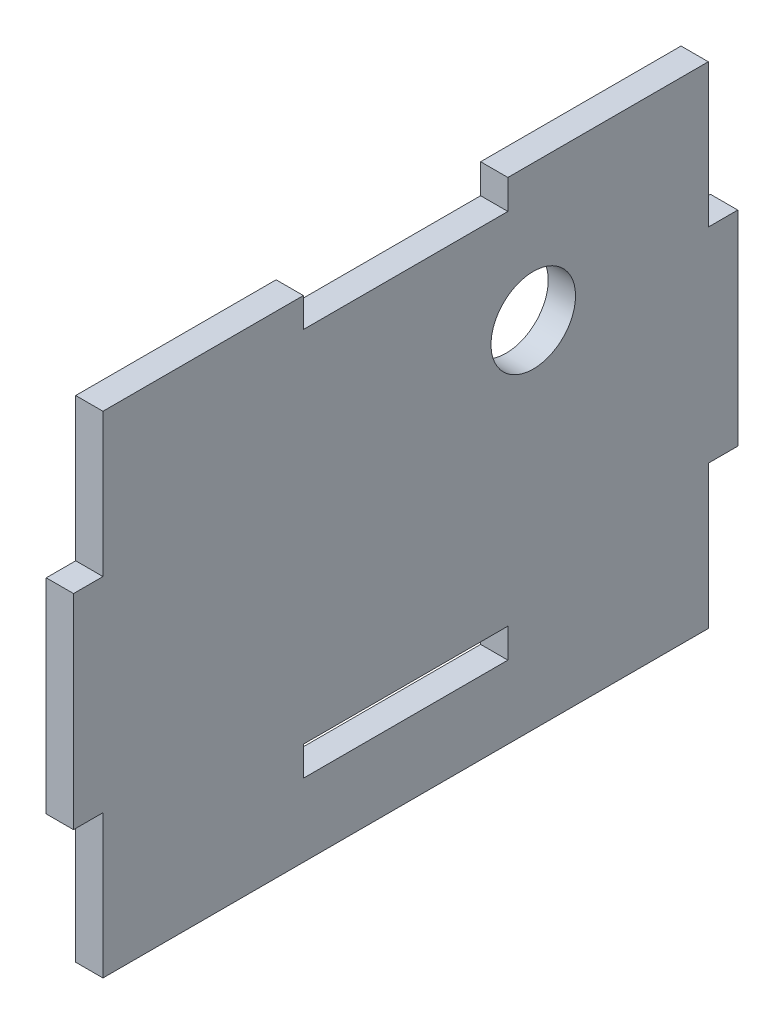
ISO-10303-21;
HEADER;
FILE_DESCRIPTION(('STEP AP214'),'2;1');
FILE_NAME('part.step','',(''),(''),'','','');
FILE_SCHEMA(('AUTOMOTIVE_DESIGN { 1 0 10303 214 1 1 1 1 }'));
ENDSEC;
DATA;
#1=APPLICATION_CONTEXT('core data for automotive mechanical design processes');
#2=APPLICATION_PROTOCOL_DEFINITION('international standard','automotive_design',2000,#1);
#3=PRODUCT_CONTEXT('',#1,'mechanical');
#4=PRODUCT('Part','Part','',(#3));
#5=PRODUCT_RELATED_PRODUCT_CATEGORY('part','',(#4));
#6=PRODUCT_DEFINITION_FORMATION('','',#4);
#7=PRODUCT_DEFINITION_CONTEXT('part definition',#1,'design');
#8=PRODUCT_DEFINITION('design','',#6,#7);
#9=PRODUCT_DEFINITION_SHAPE('','',#8);
#10=(LENGTH_UNIT() NAMED_UNIT(*) SI_UNIT(.MILLI.,.METRE.));
#11=(NAMED_UNIT(*) PLANE_ANGLE_UNIT() SI_UNIT($,.RADIAN.));
#12=(NAMED_UNIT(*) SI_UNIT($,.STERADIAN.) SOLID_ANGLE_UNIT());
#13=UNCERTAINTY_MEASURE_WITH_UNIT(LENGTH_MEASURE(1.E-05),#10,'distance_accuracy_value','');
#14=(GEOMETRIC_REPRESENTATION_CONTEXT(3) GLOBAL_UNCERTAINTY_ASSIGNED_CONTEXT((#13)) GLOBAL_UNIT_ASSIGNED_CONTEXT((#10,
#11,#12)) REPRESENTATION_CONTEXT('',''));
#15=CARTESIAN_POINT('',(0.,0.,0.));
#16=DIRECTION('',(0.,0.,1.));
#17=DIRECTION('',(1.,0.,0.));
#18=AXIS2_PLACEMENT_3D('',#15,#16,#17);
#19=CARTESIAN_POINT('',(2.54,22.86,-28.194));
#20=DIRECTION('',(0.,-1.,0.));
#21=DIRECTION('',(0.,0.,-1.));
#22=AXIS2_PLACEMENT_3D('',#19,#20,#21);
#23=PLANE('',#22);
#24=DIRECTION('',(0.,0.,1.));
#25=VECTOR('',#24,1.);
#26=CARTESIAN_POINT('',(0.,22.86,-28.194));
#27=LINE('',#26,#25);
#28=CARTESIAN_POINT('',(0.,22.86,-28.194));
#29=VERTEX_POINT('',#28);
#30=CARTESIAN_POINT('',(0.,22.86,-9.52499999999999));
#31=VERTEX_POINT('',#30);
#32=EDGE_CURVE('E186',#29,#31,#27,.T.);
#33=ORIENTED_EDGE('',*,*,#32,.T.);
#34=DIRECTION('',(1.,0.,0.));
#35=VECTOR('',#34,1.);
#36=CARTESIAN_POINT('',(0.,22.86,-9.52499999999999));
#37=LINE('',#36,#35);
#38=CARTESIAN_POINT('',(2.54,22.86,-9.52499999999999));
#39=VERTEX_POINT('',#38);
#40=EDGE_CURVE('E170',#31,#39,#37,.T.);
#41=ORIENTED_EDGE('',*,*,#40,.T.);
#42=DIRECTION('',(0.,0.,1.));
#43=VECTOR('',#42,1.);
#44=CARTESIAN_POINT('',(2.54,22.86,-28.194));
#45=LINE('',#44,#43);
#46=CARTESIAN_POINT('',(2.54,22.86,-28.194));
#47=VERTEX_POINT('',#46);
#48=EDGE_CURVE('E206',#47,#39,#45,.T.);
#49=ORIENTED_EDGE('',*,*,#48,.F.);
#50=DIRECTION('',(-1.,0.,0.));
#51=VECTOR('',#50,1.);
#52=CARTESIAN_POINT('',(2.54,22.86,-28.194));
#53=LINE('',#52,#51);
#54=EDGE_CURVE('E193',#47,#29,#53,.T.);
#55=ORIENTED_EDGE('',*,*,#54,.T.);
#56=EDGE_LOOP('',(#33,#41,#49,#55));
#57=FACE_BOUND('',#56,.T.);
#58=ADVANCED_FACE('F33',(#57),#23,.F.);
#59=CARTESIAN_POINT('',(2.54,-22.86,-28.194));
#60=DIRECTION('',(0.,0.,1.));
#61=DIRECTION('',(1.,0.,0.));
#62=AXIS2_PLACEMENT_3D('',#59,#60,#61);
#63=PLANE('',#62);
#64=DIRECTION('',(1.,0.,0.));
#65=VECTOR('',#64,1.);
#66=CARTESIAN_POINT('',(-19.246496986205,9.525,-28.194));
#67=LINE('',#66,#65);
#68=CARTESIAN_POINT('',(0.,9.525,-28.194));
#69=VERTEX_POINT('',#68);
#70=CARTESIAN_POINT('',(2.54,9.525,-28.194));
#71=VERTEX_POINT('',#70);
#72=EDGE_CURVE('E271',#69,#71,#67,.T.);
#73=ORIENTED_EDGE('',*,*,#72,.F.);
#74=DIRECTION('',(0.,1.,0.));
#75=VECTOR('',#74,1.);
#76=CARTESIAN_POINT('',(0.,-22.86,-28.194));
#77=LINE('',#76,#75);
#78=EDGE_CURVE('E224',#69,#29,#77,.T.);
#79=ORIENTED_EDGE('',*,*,#78,.T.);
#80=ORIENTED_EDGE('',*,*,#54,.F.);
#81=DIRECTION('',(0.,1.,0.));
#82=VECTOR('',#81,1.);
#83=CARTESIAN_POINT('',(2.54,-22.86,-28.194));
#84=LINE('',#83,#82);
#85=EDGE_CURVE('E233',#71,#47,#84,.T.);
#86=ORIENTED_EDGE('',*,*,#85,.F.);
#87=EDGE_LOOP('',(#73,#79,#80,#86));
#88=FACE_BOUND('',#87,.T.);
#89=ADVANCED_FACE('F374',(#88),#63,.F.);
#90=CARTESIAN_POINT('',(2.54,-22.86,28.194));
#91=DIRECTION('',(0.,0.,-1.));
#92=DIRECTION('',(-1.,0.,0.));
#93=AXIS2_PLACEMENT_3D('',#90,#91,#92);
#94=PLANE('',#93);
#95=DIRECTION('',(1.,0.,0.));
#96=VECTOR('',#95,1.);
#97=CARTESIAN_POINT('',(-19.246496986205,-9.525,28.194));
#98=LINE('',#97,#96);
#99=CARTESIAN_POINT('',(0.,-9.525,28.194));
#100=VERTEX_POINT('',#99);
#101=CARTESIAN_POINT('',(2.54,-9.525,28.194));
#102=VERTEX_POINT('',#101);
#103=EDGE_CURVE('E248',#100,#102,#98,.T.);
#104=ORIENTED_EDGE('',*,*,#103,.F.);
#105=DIRECTION('',(0.,-1.,0.));
#106=VECTOR('',#105,1.);
#107=CARTESIAN_POINT('',(0.,-22.86,28.194));
#108=LINE('',#107,#106);
#109=CARTESIAN_POINT('',(0.,-22.86,28.194));
#110=VERTEX_POINT('',#109);
#111=EDGE_CURVE('E227',#100,#110,#108,.T.);
#112=ORIENTED_EDGE('',*,*,#111,.T.);
#113=DIRECTION('',(-1.,0.,0.));
#114=VECTOR('',#113,1.);
#115=CARTESIAN_POINT('',(2.54,-22.86,28.194));
#116=LINE('',#115,#114);
#117=CARTESIAN_POINT('',(2.54,-22.86,28.194));
#118=VERTEX_POINT('',#117);
#119=EDGE_CURVE('E11',#118,#110,#116,.T.);
#120=ORIENTED_EDGE('',*,*,#119,.F.);
#121=DIRECTION('',(0.,-1.,0.));
#122=VECTOR('',#121,1.);
#123=CARTESIAN_POINT('',(2.54,-22.86,28.194));
#124=LINE('',#123,#122);
#125=EDGE_CURVE('E194',#102,#118,#124,.T.);
#126=ORIENTED_EDGE('',*,*,#125,.F.);
#127=EDGE_LOOP('',(#104,#112,#120,#126));
#128=FACE_BOUND('',#127,.T.);
#129=ADVANCED_FACE('F379',(#128),#94,.F.);
#130=CARTESIAN_POINT('',(0.,22.86,28.194));
#131=VERTEX_POINT('',#130);
#132=CARTESIAN_POINT('',(0.,9.525,28.194));
#133=VERTEX_POINT('',#132);
#134=EDGE_CURVE('E226',#131,#133,#108,.T.);
#135=ORIENTED_EDGE('',*,*,#134,.T.);
#136=DIRECTION('',(1.,0.,0.));
#137=VECTOR('',#136,1.);
#138=CARTESIAN_POINT('',(-19.246496986205,9.525,28.194));
#139=LINE('',#138,#137);
#140=CARTESIAN_POINT('',(2.54,9.525,28.194));
#141=VERTEX_POINT('',#140);
#142=EDGE_CURVE('E241',#133,#141,#139,.T.);
#143=ORIENTED_EDGE('',*,*,#142,.T.);
#144=CARTESIAN_POINT('',(2.54,22.86,28.194));
#145=VERTEX_POINT('',#144);
#146=EDGE_CURVE('E197',#145,#141,#124,.T.);
#147=ORIENTED_EDGE('',*,*,#146,.F.);
#148=DIRECTION('',(-1.,0.,0.));
#149=VECTOR('',#148,1.);
#150=CARTESIAN_POINT('',(2.54,22.86,28.194));
#151=LINE('',#150,#149);
#152=EDGE_CURVE('E203',#145,#131,#151,.T.);
#153=ORIENTED_EDGE('',*,*,#152,.T.);
#154=EDGE_LOOP('',(#135,#143,#147,#153));
#155=FACE_BOUND('',#154,.T.);
#156=ADVANCED_FACE('F35',(#155),#94,.F.);
#157=CARTESIAN_POINT('',(2.54,-22.86,-28.194));
#158=DIRECTION('',(0.,1.,0.));
#159=DIRECTION('',(0.,0.,1.));
#160=AXIS2_PLACEMENT_3D('',#157,#158,#159);
#161=PLANE('',#160);
#162=DIRECTION('',(0.,0.,-1.));
#163=VECTOR('',#162,1.);
#164=CARTESIAN_POINT('',(0.,-22.86,-28.194));
#165=LINE('',#164,#163);
#166=CARTESIAN_POINT('',(0.,-22.86,-28.194));
#167=VERTEX_POINT('',#166);
#168=EDGE_CURVE('E220',#110,#167,#165,.T.);
#169=ORIENTED_EDGE('',*,*,#168,.T.);
#170=DIRECTION('',(-1.,0.,0.));
#171=VECTOR('',#170,1.);
#172=CARTESIAN_POINT('',(2.54,-22.86,-28.194));
#173=LINE('',#172,#171);
#174=CARTESIAN_POINT('',(2.54,-22.86,-28.194));
#175=VERTEX_POINT('',#174);
#176=EDGE_CURVE('E41',#175,#167,#173,.T.);
#177=ORIENTED_EDGE('',*,*,#176,.F.);
#178=DIRECTION('',(0.,0.,-1.));
#179=VECTOR('',#178,1.);
#180=CARTESIAN_POINT('',(2.54,-22.86,-28.194));
#181=LINE('',#180,#179);
#182=EDGE_CURVE('E234',#118,#175,#181,.T.);
#183=ORIENTED_EDGE('',*,*,#182,.F.);
#184=ORIENTED_EDGE('',*,*,#119,.T.);
#185=EDGE_LOOP('',(#169,#177,#183,#184));
#186=FACE_BOUND('',#185,.T.);
#187=ADVANCED_FACE('F388',(#186),#161,.F.);
#188=CARTESIAN_POINT('',(0.,-9.525,-28.194));
#189=VERTEX_POINT('',#188);
#190=EDGE_CURVE('E199',#167,#189,#77,.T.);
#191=ORIENTED_EDGE('',*,*,#190,.T.);
#192=DIRECTION('',(1.,0.,0.));
#193=VECTOR('',#192,1.);
#194=CARTESIAN_POINT('',(-19.246496986205,-9.525,-28.194));
#195=LINE('',#194,#193);
#196=CARTESIAN_POINT('',(2.54,-9.525,-28.194));
#197=VERTEX_POINT('',#196);
#198=EDGE_CURVE('E264',#189,#197,#195,.T.);
#199=ORIENTED_EDGE('',*,*,#198,.T.);
#200=EDGE_CURVE('E215',#175,#197,#84,.T.);
#201=ORIENTED_EDGE('',*,*,#200,.F.);
#202=ORIENTED_EDGE('',*,*,#176,.T.);
#203=EDGE_LOOP('',(#191,#199,#201,#202));
#204=FACE_BOUND('',#203,.T.);
#205=ADVANCED_FACE('F212',(#204),#63,.F.);
#206=CARTESIAN_POINT('',(2.54,22.86,9.52500000000001));
#207=VERTEX_POINT('',#206);
#208=EDGE_CURVE('E231',#207,#145,#45,.T.);
#209=ORIENTED_EDGE('',*,*,#208,.F.);
#210=DIRECTION('',(1.,0.,0.));
#211=VECTOR('',#210,1.);
#212=CARTESIAN_POINT('',(0.,22.86,9.52500000000001));
#213=LINE('',#212,#211);
#214=CARTESIAN_POINT('',(0.,22.86,9.52500000000001));
#215=VERTEX_POINT('',#214);
#216=EDGE_CURVE('E180',#215,#207,#213,.T.);
#217=ORIENTED_EDGE('',*,*,#216,.F.);
#218=EDGE_CURVE('E195',#215,#131,#27,.T.);
#219=ORIENTED_EDGE('',*,*,#218,.T.);
#220=ORIENTED_EDGE('',*,*,#152,.F.);
#221=EDGE_LOOP('',(#209,#217,#219,#220));
#222=FACE_BOUND('',#221,.T.);
#223=ADVANCED_FACE('F347',(#222),#23,.F.);
#224=CARTESIAN_POINT('',(2.54,0.,0.));
#225=DIRECTION('',(1.,0.,0.));
#226=DIRECTION('',(0.,0.,-1.));
#227=AXIS2_PLACEMENT_3D('',#224,#225,#226);
#228=PLANE('',#227);
#229=CARTESIAN_POINT('',(2.54,10.16,-11.8872));
#230=DIRECTION('',(1.,0.,0.));
#231=DIRECTION('',(0.,0.,-1.));
#232=AXIS2_PLACEMENT_3D('',#229,#230,#231);
#233=CIRCLE('',#232,3.937);
#234=CARTESIAN_POINT('',(2.54,10.16,-15.8242));
#235=VERTEX_POINT('',#234);
#236=EDGE_CURVE('E329',#235,#235,#233,.T.);
#237=ORIENTED_EDGE('',*,*,#236,.F.);
#238=EDGE_LOOP('',(#237));
#239=FACE_BOUND('',#238,.T.);
#240=DIRECTION('',(0.,1.,0.));
#241=VECTOR('',#240,1.);
#242=CARTESIAN_POINT('',(2.54,20.1168,-9.52499999999999));
#243=LINE('',#242,#241);
#244=CARTESIAN_POINT('',(2.54,20.1168,-9.52499999999999));
#245=VERTEX_POINT('',#244);
#246=EDGE_CURVE('E175',#245,#39,#243,.T.);
#247=ORIENTED_EDGE('',*,*,#246,.F.);
#248=DIRECTION('',(0.,0.,-1.));
#249=VECTOR('',#248,1.);
#250=CARTESIAN_POINT('',(2.54,20.1168,9.52500000000001));
#251=LINE('',#250,#249);
#252=CARTESIAN_POINT('',(2.54,20.1168,9.52500000000001));
#253=VERTEX_POINT('',#252);
#254=EDGE_CURVE('E189',#253,#245,#251,.T.);
#255=ORIENTED_EDGE('',*,*,#254,.F.);
#256=DIRECTION('',(0.,-1.,0.));
#257=VECTOR('',#256,1.);
#258=CARTESIAN_POINT('',(2.54,20.1168,9.52500000000001));
#259=LINE('',#258,#257);
#260=EDGE_CURVE('E323',#207,#253,#259,.T.);
#261=ORIENTED_EDGE('',*,*,#260,.F.);
#262=ORIENTED_EDGE('',*,*,#208,.T.);
#263=ORIENTED_EDGE('',*,*,#146,.T.);
#264=DIRECTION('',(0.,0.,1.));
#265=VECTOR('',#264,1.);
#266=CARTESIAN_POINT('',(2.54,9.525,30.9372));
#267=LINE('',#266,#265);
#268=CARTESIAN_POINT('',(2.54,9.525,30.9372));
#269=VERTEX_POINT('',#268);
#270=EDGE_CURVE('E257',#141,#269,#267,.T.);
#271=ORIENTED_EDGE('',*,*,#270,.T.);
#272=DIRECTION('',(0.,-1.,0.));
#273=VECTOR('',#272,1.);
#274=CARTESIAN_POINT('',(2.54,9.525,30.9372));
#275=LINE('',#274,#273);
#276=CARTESIAN_POINT('',(2.54,-9.525,30.9372));
#277=VERTEX_POINT('',#276);
#278=EDGE_CURVE('E254',#269,#277,#275,.T.);
#279=ORIENTED_EDGE('',*,*,#278,.T.);
#280=DIRECTION('',(0.,0.,-1.));
#281=VECTOR('',#280,1.);
#282=CARTESIAN_POINT('',(2.54,-9.525,30.9372));
#283=LINE('',#282,#281);
#284=EDGE_CURVE('E244',#277,#102,#283,.T.);
#285=ORIENTED_EDGE('',*,*,#284,.T.);
#286=ORIENTED_EDGE('',*,*,#125,.T.);
#287=ORIENTED_EDGE('',*,*,#182,.T.);
#288=ORIENTED_EDGE('',*,*,#200,.T.);
#289=DIRECTION('',(0.,0.,-1.));
#290=VECTOR('',#289,1.);
#291=CARTESIAN_POINT('',(2.54,-9.525,-30.9372));
#292=LINE('',#291,#290);
#293=CARTESIAN_POINT('',(2.54,-9.525,-30.9372));
#294=VERTEX_POINT('',#293);
#295=EDGE_CURVE('E280',#197,#294,#292,.T.);
#296=ORIENTED_EDGE('',*,*,#295,.T.);
#297=DIRECTION('',(0.,1.,0.));
#298=VECTOR('',#297,1.);
#299=CARTESIAN_POINT('',(2.54,9.525,-30.9372));
#300=LINE('',#299,#298);
#301=CARTESIAN_POINT('',(2.54,9.525,-30.9372));
#302=VERTEX_POINT('',#301);
#303=EDGE_CURVE('E277',#294,#302,#300,.T.);
#304=ORIENTED_EDGE('',*,*,#303,.T.);
#305=DIRECTION('',(0.,0.,1.));
#306=VECTOR('',#305,1.);
#307=CARTESIAN_POINT('',(2.54,9.525,-30.9372));
#308=LINE('',#307,#306);
#309=EDGE_CURVE('E267',#302,#71,#308,.T.);
#310=ORIENTED_EDGE('',*,*,#309,.T.);
#311=ORIENTED_EDGE('',*,*,#85,.T.);
#312=ORIENTED_EDGE('',*,*,#48,.T.);
#313=EDGE_LOOP('',(#247,#255,#261,#262,#263,#271,#279,#285,#286,#287,#288,#296,#304,#310,#311,#312));
#314=FACE_BOUND('',#313,.T.);
#315=DIRECTION('',(0.,-1.,0.));
#316=VECTOR('',#315,1.);
#317=CARTESIAN_POINT('',(2.54,-13.335,9.525));
#318=LINE('',#317,#316);
#319=CARTESIAN_POINT('',(2.54,-13.335,9.525));
#320=VERTEX_POINT('',#319);
#321=CARTESIAN_POINT('',(2.54,-16.0782,9.525));
#322=VERTEX_POINT('',#321);
#323=EDGE_CURVE('E48',#320,#322,#318,.T.);
#324=ORIENTED_EDGE('',*,*,#323,.F.);
#325=DIRECTION('',(0.,0.,1.));
#326=VECTOR('',#325,1.);
#327=CARTESIAN_POINT('',(2.54,-13.335,-9.525));
#328=LINE('',#327,#326);
#329=CARTESIAN_POINT('',(2.54,-13.335,-9.525));
#330=VERTEX_POINT('',#329);
#331=EDGE_CURVE('E295',#330,#320,#328,.T.);
#332=ORIENTED_EDGE('',*,*,#331,.F.);
#333=DIRECTION('',(0.,1.,0.));
#334=VECTOR('',#333,1.);
#335=CARTESIAN_POINT('',(2.54,-13.335,-9.525));
#336=LINE('',#335,#334);
#337=CARTESIAN_POINT('',(2.54,-16.0782,-9.525));
#338=VERTEX_POINT('',#337);
#339=EDGE_CURVE('E299',#338,#330,#336,.T.);
#340=ORIENTED_EDGE('',*,*,#339,.F.);
#341=DIRECTION('',(0.,0.,-1.));
#342=VECTOR('',#341,1.);
#343=CARTESIAN_POINT('',(2.54,-16.0782,-9.525));
#344=LINE('',#343,#342);
#345=EDGE_CURVE('E302',#322,#338,#344,.T.);
#346=ORIENTED_EDGE('',*,*,#345,.F.);
#347=EDGE_LOOP('',(#324,#332,#340,#346));
#348=FACE_BOUND('',#347,.T.);
#349=ADVANCED_FACE('F344',(#239,#314,#348),#228,.T.);
#350=CARTESIAN_POINT('',(0.,0.,0.));
#351=DIRECTION('',(1.,0.,0.));
#352=DIRECTION('',(0.,0.,-1.));
#353=AXIS2_PLACEMENT_3D('',#350,#351,#352);
#354=PLANE('',#353);
#355=CARTESIAN_POINT('',(0.,10.16,-11.8872));
#356=DIRECTION('',(1.,0.,0.));
#357=DIRECTION('',(0.,0.,-1.));
#358=AXIS2_PLACEMENT_3D('',#355,#356,#357);
#359=CIRCLE('',#358,3.937);
#360=CARTESIAN_POINT('',(0.,10.16,-15.8242));
#361=VERTEX_POINT('',#360);
#362=EDGE_CURVE('E306',#361,#361,#359,.T.);
#363=ORIENTED_EDGE('',*,*,#362,.T.);
#364=EDGE_LOOP('',(#363));
#365=FACE_BOUND('',#364,.T.);
#366=DIRECTION('',(0.,0.,1.));
#367=VECTOR('',#366,1.);
#368=CARTESIAN_POINT('',(0.,-13.335,-9.525));
#369=LINE('',#368,#367);
#370=CARTESIAN_POINT('',(0.,-13.335,-9.525));
#371=VERTEX_POINT('',#370);
#372=CARTESIAN_POINT('',(0.,-13.335,9.525));
#373=VERTEX_POINT('',#372);
#374=EDGE_CURVE('E289',#371,#373,#369,.T.);
#375=ORIENTED_EDGE('',*,*,#374,.T.);
#376=DIRECTION('',(0.,-1.,0.));
#377=VECTOR('',#376,1.);
#378=CARTESIAN_POINT('',(0.,-13.335,9.525));
#379=LINE('',#378,#377);
#380=CARTESIAN_POINT('',(0.,-16.0782,9.525));
#381=VERTEX_POINT('',#380);
#382=EDGE_CURVE('E298',#373,#381,#379,.T.);
#383=ORIENTED_EDGE('',*,*,#382,.T.);
#384=DIRECTION('',(0.,0.,-1.));
#385=VECTOR('',#384,1.);
#386=CARTESIAN_POINT('',(0.,-16.0782,-9.525));
#387=LINE('',#386,#385);
#388=CARTESIAN_POINT('',(0.,-16.0782,-9.525));
#389=VERTEX_POINT('',#388);
#390=EDGE_CURVE('E312',#381,#389,#387,.T.);
#391=ORIENTED_EDGE('',*,*,#390,.T.);
#392=DIRECTION('',(0.,1.,0.));
#393=VECTOR('',#392,1.);
#394=CARTESIAN_POINT('',(0.,-13.335,-9.525));
#395=LINE('',#394,#393);
#396=EDGE_CURVE('E309',#389,#371,#395,.T.);
#397=ORIENTED_EDGE('',*,*,#396,.T.);
#398=EDGE_LOOP('',(#375,#383,#391,#397));
#399=FACE_BOUND('',#398,.T.);
#400=DIRECTION('',(0.,0.,-1.));
#401=VECTOR('',#400,1.);
#402=CARTESIAN_POINT('',(0.,20.1168,9.52500000000001));
#403=LINE('',#402,#401);
#404=CARTESIAN_POINT('',(0.,20.1168,9.52500000000001));
#405=VERTEX_POINT('',#404);
#406=CARTESIAN_POINT('',(0.,20.1168,-9.52499999999999));
#407=VERTEX_POINT('',#406);
#408=EDGE_CURVE('E56',#405,#407,#403,.T.);
#409=ORIENTED_EDGE('',*,*,#408,.T.);
#410=DIRECTION('',(0.,1.,0.));
#411=VECTOR('',#410,1.);
#412=CARTESIAN_POINT('',(0.,20.1168,-9.52499999999999));
#413=LINE('',#412,#411);
#414=EDGE_CURVE('E173',#407,#31,#413,.T.);
#415=ORIENTED_EDGE('',*,*,#414,.T.);
#416=ORIENTED_EDGE('',*,*,#32,.F.);
#417=ORIENTED_EDGE('',*,*,#78,.F.);
#418=DIRECTION('',(0.,0.,-1.));
#419=VECTOR('',#418,1.);
#420=CARTESIAN_POINT('',(0.,9.525,-30.9372));
#421=LINE('',#420,#419);
#422=CARTESIAN_POINT('',(0.,9.525,-30.9372));
#423=VERTEX_POINT('',#422);
#424=EDGE_CURVE('E263',#69,#423,#421,.T.);
#425=ORIENTED_EDGE('',*,*,#424,.T.);
#426=DIRECTION('',(0.,-1.,0.));
#427=VECTOR('',#426,1.);
#428=CARTESIAN_POINT('',(0.,9.525,-30.9372));
#429=LINE('',#428,#427);
#430=CARTESIAN_POINT('',(0.,-9.525,-30.9372));
#431=VERTEX_POINT('',#430);
#432=EDGE_CURVE('E274',#423,#431,#429,.T.);
#433=ORIENTED_EDGE('',*,*,#432,.T.);
#434=DIRECTION('',(0.,0.,1.));
#435=VECTOR('',#434,1.);
#436=CARTESIAN_POINT('',(0.,-9.525,-30.9372));
#437=LINE('',#436,#435);
#438=EDGE_CURVE('E222',#431,#189,#437,.T.);
#439=ORIENTED_EDGE('',*,*,#438,.T.);
#440=ORIENTED_EDGE('',*,*,#190,.F.);
#441=ORIENTED_EDGE('',*,*,#168,.F.);
#442=ORIENTED_EDGE('',*,*,#111,.F.);
#443=DIRECTION('',(0.,0.,1.));
#444=VECTOR('',#443,1.);
#445=CARTESIAN_POINT('',(0.,-9.525,30.9372));
#446=LINE('',#445,#444);
#447=CARTESIAN_POINT('',(0.,-9.525,30.9372));
#448=VERTEX_POINT('',#447);
#449=EDGE_CURVE('E240',#100,#448,#446,.T.);
#450=ORIENTED_EDGE('',*,*,#449,.T.);
#451=DIRECTION('',(0.,1.,0.));
#452=VECTOR('',#451,1.);
#453=CARTESIAN_POINT('',(0.,9.525,30.9372));
#454=LINE('',#453,#452);
#455=CARTESIAN_POINT('',(0.,9.525,30.9372));
#456=VERTEX_POINT('',#455);
#457=EDGE_CURVE('E251',#448,#456,#454,.T.);
#458=ORIENTED_EDGE('',*,*,#457,.T.);
#459=DIRECTION('',(0.,0.,-1.));
#460=VECTOR('',#459,1.);
#461=CARTESIAN_POINT('',(0.,9.525,30.9372));
#462=LINE('',#461,#460);
#463=EDGE_CURVE('E237',#456,#133,#462,.T.);
#464=ORIENTED_EDGE('',*,*,#463,.T.);
#465=ORIENTED_EDGE('',*,*,#134,.F.);
#466=ORIENTED_EDGE('',*,*,#218,.F.);
#467=DIRECTION('',(0.,-1.,0.));
#468=VECTOR('',#467,1.);
#469=CARTESIAN_POINT('',(0.,20.1168,9.52500000000001));
#470=LINE('',#469,#468);
#471=EDGE_CURVE('E188',#215,#405,#470,.T.);
#472=ORIENTED_EDGE('',*,*,#471,.T.);
#473=EDGE_LOOP('',(#409,#415,#416,#417,#425,#433,#439,#440,#441,#442,#450,#458,#464,#465,#466,#472));
#474=FACE_BOUND('',#473,.T.);
#475=ADVANCED_FACE('F184',(#365,#399,#474),#354,.F.);
#476=CARTESIAN_POINT('',(-19.246496986205,-9.525,30.9372));
#477=DIRECTION('',(0.,-1.,0.));
#478=DIRECTION('',(0.,0.,-1.));
#479=AXIS2_PLACEMENT_3D('',#476,#477,#478);
#480=PLANE('',#479);
#481=ORIENTED_EDGE('',*,*,#449,.F.);
#482=ORIENTED_EDGE('',*,*,#103,.T.);
#483=ORIENTED_EDGE('',*,*,#284,.F.);
#484=DIRECTION('',(1.,0.,0.));
#485=VECTOR('',#484,1.);
#486=CARTESIAN_POINT('',(-19.246496986205,-9.525,30.9372));
#487=LINE('',#486,#485);
#488=EDGE_CURVE('E246',#448,#277,#487,.T.);
#489=ORIENTED_EDGE('',*,*,#488,.F.);
#490=EDGE_LOOP('',(#481,#482,#483,#489));
#491=FACE_BOUND('',#490,.T.);
#492=ADVANCED_FACE('F410',(#491),#480,.T.);
#493=CARTESIAN_POINT('',(-19.246496986205,9.525,30.9372));
#494=DIRECTION('',(0.,0.,1.));
#495=DIRECTION('',(1.,0.,0.));
#496=AXIS2_PLACEMENT_3D('',#493,#494,#495);
#497=PLANE('',#496);
#498=ORIENTED_EDGE('',*,*,#457,.F.);
#499=ORIENTED_EDGE('',*,*,#488,.T.);
#500=ORIENTED_EDGE('',*,*,#278,.F.);
#501=DIRECTION('',(1.,0.,0.));
#502=VECTOR('',#501,1.);
#503=CARTESIAN_POINT('',(-19.246496986205,9.525,30.9372));
#504=LINE('',#503,#502);
#505=EDGE_CURVE('E243',#456,#269,#504,.T.);
#506=ORIENTED_EDGE('',*,*,#505,.F.);
#507=EDGE_LOOP('',(#498,#499,#500,#506));
#508=FACE_BOUND('',#507,.T.);
#509=ADVANCED_FACE('F414',(#508),#497,.T.);
#510=CARTESIAN_POINT('',(-19.246496986205,9.525,30.9372));
#511=DIRECTION('',(0.,1.,0.));
#512=DIRECTION('',(0.,0.,1.));
#513=AXIS2_PLACEMENT_3D('',#510,#511,#512);
#514=PLANE('',#513);
#515=ORIENTED_EDGE('',*,*,#463,.F.);
#516=ORIENTED_EDGE('',*,*,#505,.T.);
#517=ORIENTED_EDGE('',*,*,#270,.F.);
#518=ORIENTED_EDGE('',*,*,#142,.F.);
#519=EDGE_LOOP('',(#515,#516,#517,#518));
#520=FACE_BOUND('',#519,.T.);
#521=ADVANCED_FACE('F402',(#520),#514,.T.);
#522=CARTESIAN_POINT('',(-19.246496986205,9.525,-30.9372));
#523=DIRECTION('',(0.,1.,0.));
#524=DIRECTION('',(0.,0.,1.));
#525=AXIS2_PLACEMENT_3D('',#522,#523,#524);
#526=PLANE('',#525);
#527=ORIENTED_EDGE('',*,*,#424,.F.);
#528=ORIENTED_EDGE('',*,*,#72,.T.);
#529=ORIENTED_EDGE('',*,*,#309,.F.);
#530=DIRECTION('',(1.,0.,0.));
#531=VECTOR('',#530,1.);
#532=CARTESIAN_POINT('',(-19.246496986205,9.525,-30.9372));
#533=LINE('',#532,#531);
#534=EDGE_CURVE('E269',#423,#302,#533,.T.);
#535=ORIENTED_EDGE('',*,*,#534,.F.);
#536=EDGE_LOOP('',(#527,#528,#529,#535));
#537=FACE_BOUND('',#536,.T.);
#538=ADVANCED_FACE('F421',(#537),#526,.T.);
#539=CARTESIAN_POINT('',(-19.246496986205,9.525,-30.9372));
#540=DIRECTION('',(0.,0.,-1.));
#541=DIRECTION('',(0.,1.,0.));
#542=AXIS2_PLACEMENT_3D('',#539,#540,#541);
#543=PLANE('',#542);
#544=ORIENTED_EDGE('',*,*,#432,.F.);
#545=ORIENTED_EDGE('',*,*,#534,.T.);
#546=ORIENTED_EDGE('',*,*,#303,.F.);
#547=DIRECTION('',(1.,0.,0.));
#548=VECTOR('',#547,1.);
#549=CARTESIAN_POINT('',(-19.246496986205,-9.525,-30.9372));
#550=LINE('',#549,#548);
#551=EDGE_CURVE('E266',#431,#294,#550,.T.);
#552=ORIENTED_EDGE('',*,*,#551,.F.);
#553=EDGE_LOOP('',(#544,#545,#546,#552));
#554=FACE_BOUND('',#553,.T.);
#555=ADVANCED_FACE('F496',(#554),#543,.T.);
#556=CARTESIAN_POINT('',(-19.246496986205,-9.525,-30.9372));
#557=DIRECTION('',(0.,-1.,0.));
#558=DIRECTION('',(0.,0.,-1.));
#559=AXIS2_PLACEMENT_3D('',#556,#557,#558);
#560=PLANE('',#559);
#561=ORIENTED_EDGE('',*,*,#438,.F.);
#562=ORIENTED_EDGE('',*,*,#551,.T.);
#563=ORIENTED_EDGE('',*,*,#295,.F.);
#564=ORIENTED_EDGE('',*,*,#198,.F.);
#565=EDGE_LOOP('',(#561,#562,#563,#564));
#566=FACE_BOUND('',#565,.T.);
#567=ADVANCED_FACE('F476',(#566),#560,.T.);
#568=CARTESIAN_POINT('',(0.,-13.335,9.525));
#569=DIRECTION('',(0.,0.,1.));
#570=DIRECTION('',(1.,0.,0.));
#571=AXIS2_PLACEMENT_3D('',#568,#569,#570);
#572=PLANE('',#571);
#573=ORIENTED_EDGE('',*,*,#323,.T.);
#574=DIRECTION('',(1.,0.,0.));
#575=VECTOR('',#574,1.);
#576=CARTESIAN_POINT('',(0.,-16.0782,9.525));
#577=LINE('',#576,#575);
#578=EDGE_CURVE('E286',#381,#322,#577,.T.);
#579=ORIENTED_EDGE('',*,*,#578,.F.);
#580=ORIENTED_EDGE('',*,*,#382,.F.);
#581=DIRECTION('',(1.,0.,0.));
#582=VECTOR('',#581,1.);
#583=CARTESIAN_POINT('',(0.,-13.335,9.525));
#584=LINE('',#583,#582);
#585=EDGE_CURVE('E293',#373,#320,#584,.T.);
#586=ORIENTED_EDGE('',*,*,#585,.T.);
#587=EDGE_LOOP('',(#573,#579,#580,#586));
#588=FACE_BOUND('',#587,.T.);
#589=ADVANCED_FACE('F359',(#588),#572,.F.);
#590=CARTESIAN_POINT('',(0.,-13.335,-9.525));
#591=DIRECTION('',(0.,1.,0.));
#592=DIRECTION('',(0.,0.,1.));
#593=AXIS2_PLACEMENT_3D('',#590,#591,#592);
#594=PLANE('',#593);
#595=ORIENTED_EDGE('',*,*,#331,.T.);
#596=ORIENTED_EDGE('',*,*,#585,.F.);
#597=ORIENTED_EDGE('',*,*,#374,.F.);
#598=DIRECTION('',(1.,0.,0.));
#599=VECTOR('',#598,1.);
#600=CARTESIAN_POINT('',(0.,-13.335,-9.525));
#601=LINE('',#600,#599);
#602=EDGE_CURVE('E291',#371,#330,#601,.T.);
#603=ORIENTED_EDGE('',*,*,#602,.T.);
#604=EDGE_LOOP('',(#595,#596,#597,#603));
#605=FACE_BOUND('',#604,.T.);
#606=ADVANCED_FACE('F362',(#605),#594,.F.);
#607=CARTESIAN_POINT('',(0.,-13.335,-9.525));
#608=DIRECTION('',(0.,0.,-1.));
#609=DIRECTION('',(-1.,0.,0.));
#610=AXIS2_PLACEMENT_3D('',#607,#608,#609);
#611=PLANE('',#610);
#612=ORIENTED_EDGE('',*,*,#339,.T.);
#613=ORIENTED_EDGE('',*,*,#602,.F.);
#614=ORIENTED_EDGE('',*,*,#396,.F.);
#615=DIRECTION('',(1.,0.,0.));
#616=VECTOR('',#615,1.);
#617=CARTESIAN_POINT('',(0.,-16.0782,-9.525));
#618=LINE('',#617,#616);
#619=EDGE_CURVE('E288',#389,#338,#618,.T.);
#620=ORIENTED_EDGE('',*,*,#619,.T.);
#621=EDGE_LOOP('',(#612,#613,#614,#620));
#622=FACE_BOUND('',#621,.T.);
#623=ADVANCED_FACE('F364',(#622),#611,.F.);
#624=CARTESIAN_POINT('',(0.,-16.0782,-9.525));
#625=DIRECTION('',(0.,-1.,0.));
#626=DIRECTION('',(0.,0.,-1.));
#627=AXIS2_PLACEMENT_3D('',#624,#625,#626);
#628=PLANE('',#627);
#629=ORIENTED_EDGE('',*,*,#345,.T.);
#630=ORIENTED_EDGE('',*,*,#619,.F.);
#631=ORIENTED_EDGE('',*,*,#390,.F.);
#632=ORIENTED_EDGE('',*,*,#578,.T.);
#633=EDGE_LOOP('',(#629,#630,#631,#632));
#634=FACE_BOUND('',#633,.T.);
#635=ADVANCED_FACE('F356',(#634),#628,.F.);
#636=CARTESIAN_POINT('',(0.,20.1168,-9.52499999999999));
#637=DIRECTION('',(0.,0.,-1.));
#638=DIRECTION('',(-1.,0.,0.));
#639=AXIS2_PLACEMENT_3D('',#636,#637,#638);
#640=PLANE('',#639);
#641=ORIENTED_EDGE('',*,*,#246,.T.);
#642=ORIENTED_EDGE('',*,*,#40,.F.);
#643=ORIENTED_EDGE('',*,*,#414,.F.);
#644=DIRECTION('',(1.,0.,0.));
#645=VECTOR('',#644,1.);
#646=CARTESIAN_POINT('',(0.,20.1168,-9.52499999999999));
#647=LINE('',#646,#645);
#648=EDGE_CURVE('E283',#407,#245,#647,.T.);
#649=ORIENTED_EDGE('',*,*,#648,.T.);
#650=EDGE_LOOP('',(#641,#642,#643,#649));
#651=FACE_BOUND('',#650,.T.);
#652=ADVANCED_FACE('F172',(#651),#640,.F.);
#653=CARTESIAN_POINT('',(0.,20.1168,9.52500000000001));
#654=DIRECTION('',(0.,-1.,0.));
#655=DIRECTION('',(0.,0.,-1.));
#656=AXIS2_PLACEMENT_3D('',#653,#654,#655);
#657=PLANE('',#656);
#658=ORIENTED_EDGE('',*,*,#254,.T.);
#659=ORIENTED_EDGE('',*,*,#648,.F.);
#660=ORIENTED_EDGE('',*,*,#408,.F.);
#661=DIRECTION('',(1.,0.,0.));
#662=VECTOR('',#661,1.);
#663=CARTESIAN_POINT('',(0.,20.1168,9.52500000000001));
#664=LINE('',#663,#662);
#665=EDGE_CURVE('E318',#405,#253,#664,.T.);
#666=ORIENTED_EDGE('',*,*,#665,.T.);
#667=EDGE_LOOP('',(#658,#659,#660,#666));
#668=FACE_BOUND('',#667,.T.);
#669=ADVANCED_FACE('F442',(#668),#657,.F.);
#670=CARTESIAN_POINT('',(0.,20.1168,9.52500000000001));
#671=DIRECTION('',(0.,0.,1.));
#672=DIRECTION('',(1.,0.,0.));
#673=AXIS2_PLACEMENT_3D('',#670,#671,#672);
#674=PLANE('',#673);
#675=ORIENTED_EDGE('',*,*,#260,.T.);
#676=ORIENTED_EDGE('',*,*,#665,.F.);
#677=ORIENTED_EDGE('',*,*,#471,.F.);
#678=ORIENTED_EDGE('',*,*,#216,.T.);
#679=EDGE_LOOP('',(#675,#676,#677,#678));
#680=FACE_BOUND('',#679,.T.);
#681=ADVANCED_FACE('F340',(#680),#674,.F.);
#682=CARTESIAN_POINT('',(0.,10.16,-11.8872));
#683=DIRECTION('',(1.,0.,0.));
#684=DIRECTION('',(0.,0.,-1.));
#685=AXIS2_PLACEMENT_3D('',#682,#683,#684);
#686=CYLINDRICAL_SURFACE('',#685,3.937);
#687=ORIENTED_EDGE('',*,*,#362,.F.);
#688=EDGE_LOOP('',(#687));
#689=FACE_BOUND('',#688,.T.);
#690=ORIENTED_EDGE('',*,*,#236,.T.);
#691=EDGE_LOOP('',(#690));
#692=FACE_BOUND('',#691,.T.);
#693=ADVANCED_FACE('F337',(#689,#692),#686,.F.);
#694=CLOSED_SHELL('',(#58,#89,#129,#156,#187,#205,#223,#349,#475,#492,#509,#521,#538,#555,#567,
#589,#606,#623,#635,#652,#669,#681,#693));
#695=MANIFOLD_SOLID_BREP('B2',#694);
#696=ADVANCED_BREP_SHAPE_REPRESENTATION('',(#18,#695),#14);
#697=SHAPE_DEFINITION_REPRESENTATION(#9,#696);
ENDSEC;
END-ISO-10303-21;
